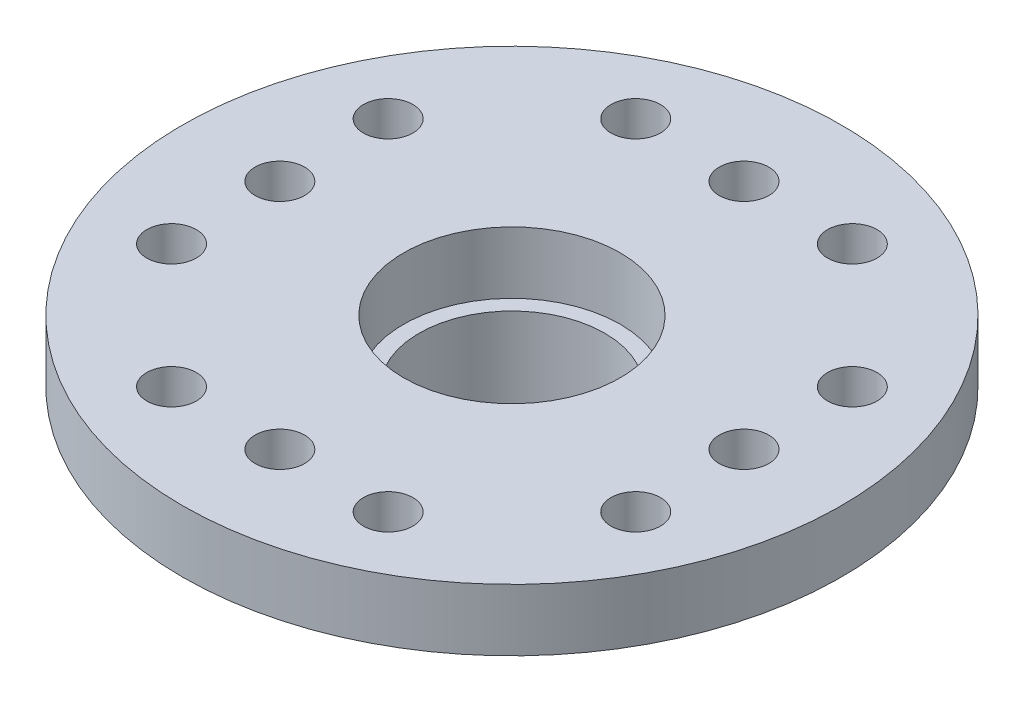
ISO-10303-21;
HEADER;
FILE_DESCRIPTION(('STEP AP214'),'2;1');
FILE_NAME('part.step','',(''),(''),'','','');
FILE_SCHEMA(('AUTOMOTIVE_DESIGN { 1 0 10303 214 1 1 1 1 }'));
ENDSEC;
DATA;
#1=APPLICATION_CONTEXT('core data for automotive mechanical design processes');
#2=APPLICATION_PROTOCOL_DEFINITION('international standard','automotive_design',2000,#1);
#3=PRODUCT_CONTEXT('',#1,'mechanical');
#4=PRODUCT('Part','Part','',(#3));
#5=PRODUCT_RELATED_PRODUCT_CATEGORY('part','',(#4));
#6=PRODUCT_DEFINITION_FORMATION('','',#4);
#7=PRODUCT_DEFINITION_CONTEXT('part definition',#1,'design');
#8=PRODUCT_DEFINITION('design','',#6,#7);
#9=PRODUCT_DEFINITION_SHAPE('','',#8);
#10=(LENGTH_UNIT() NAMED_UNIT(*) SI_UNIT(.MILLI.,.METRE.));
#11=(NAMED_UNIT(*) PLANE_ANGLE_UNIT() SI_UNIT($,.RADIAN.));
#12=(NAMED_UNIT(*) SI_UNIT($,.STERADIAN.) SOLID_ANGLE_UNIT());
#13=UNCERTAINTY_MEASURE_WITH_UNIT(LENGTH_MEASURE(1.E-05),#10,'distance_accuracy_value','');
#14=(GEOMETRIC_REPRESENTATION_CONTEXT(3) GLOBAL_UNCERTAINTY_ASSIGNED_CONTEXT((#13)) GLOBAL_UNIT_ASSIGNED_CONTEXT((#10,
#11,#12)) REPRESENTATION_CONTEXT('',''));
#15=CARTESIAN_POINT('',(0.,0.,0.));
#16=DIRECTION('',(0.,0.,1.));
#17=DIRECTION('',(1.,0.,0.));
#18=AXIS2_PLACEMENT_3D('',#15,#16,#17);
#19=CARTESIAN_POINT('',(0.,2.,0.));
#20=DIRECTION('',(0.,1.,0.));
#21=DIRECTION('',(0.,0.,1.));
#22=AXIS2_PLACEMENT_3D('',#19,#20,#21);
#23=PLANE('',#22);
#24=CARTESIAN_POINT('',(-7.5,2.,-3.5));
#25=DIRECTION('',(0.,1.,0.));
#26=DIRECTION('',(0.,0.,1.));
#27=AXIS2_PLACEMENT_3D('',#24,#25,#26);
#28=CIRCLE('',#27,0.8);
#29=CARTESIAN_POINT('',(-7.5,2.,-2.7));
#30=VERTEX_POINT('',#29);
#31=EDGE_CURVE('E109',#30,#30,#28,.T.);
#32=ORIENTED_EDGE('',*,*,#31,.F.);
#33=EDGE_LOOP('',(#32));
#34=FACE_BOUND('',#33,.T.);
#35=CARTESIAN_POINT('',(-7.5,2.,0.));
#36=DIRECTION('',(0.,1.,0.));
#37=DIRECTION('',(0.,0.,1.));
#38=AXIS2_PLACEMENT_3D('',#35,#36,#37);
#39=CIRCLE('',#38,0.800000000000001);
#40=CARTESIAN_POINT('',(-7.5,2.,0.800000000000001));
#41=VERTEX_POINT('',#40);
#42=EDGE_CURVE('E108',#41,#41,#39,.T.);
#43=ORIENTED_EDGE('',*,*,#42,.F.);
#44=EDGE_LOOP('',(#43));
#45=FACE_BOUND('',#44,.T.);
#46=CARTESIAN_POINT('',(-7.5,2.,3.5));
#47=DIRECTION('',(0.,1.,0.));
#48=DIRECTION('',(0.,0.,1.));
#49=AXIS2_PLACEMENT_3D('',#46,#47,#48);
#50=CIRCLE('',#49,0.8);
#51=CARTESIAN_POINT('',(-7.5,2.,4.3));
#52=VERTEX_POINT('',#51);
#53=EDGE_CURVE('E115',#52,#52,#50,.T.);
#54=ORIENTED_EDGE('',*,*,#53,.F.);
#55=EDGE_LOOP('',(#54));
#56=FACE_BOUND('',#55,.T.);
#57=CARTESIAN_POINT('',(-3.5,2.,7.5));
#58=DIRECTION('',(0.,1.,0.));
#59=DIRECTION('',(0.,0.,1.));
#60=AXIS2_PLACEMENT_3D('',#57,#58,#59);
#61=CIRCLE('',#60,0.8);
#62=CARTESIAN_POINT('',(-3.5,2.,8.3));
#63=VERTEX_POINT('',#62);
#64=EDGE_CURVE('E121',#63,#63,#61,.T.);
#65=ORIENTED_EDGE('',*,*,#64,.F.);
#66=EDGE_LOOP('',(#65));
#67=FACE_BOUND('',#66,.T.);
#68=CARTESIAN_POINT('',(0.,2.,7.5));
#69=DIRECTION('',(0.,1.,0.));
#70=DIRECTION('',(0.,0.,1.));
#71=AXIS2_PLACEMENT_3D('',#68,#69,#70);
#72=CIRCLE('',#71,0.8);
#73=CARTESIAN_POINT('',(0.,2.,8.3));
#74=VERTEX_POINT('',#73);
#75=EDGE_CURVE('E127',#74,#74,#72,.T.);
#76=ORIENTED_EDGE('',*,*,#75,.F.);
#77=EDGE_LOOP('',(#76));
#78=FACE_BOUND('',#77,.T.);
#79=CARTESIAN_POINT('',(3.5,2.,7.5));
#80=DIRECTION('',(0.,1.,0.));
#81=DIRECTION('',(0.,0.,1.));
#82=AXIS2_PLACEMENT_3D('',#79,#80,#81);
#83=CIRCLE('',#82,0.800000000000001);
#84=CARTESIAN_POINT('',(3.5,2.,8.3));
#85=VERTEX_POINT('',#84);
#86=EDGE_CURVE('E133',#85,#85,#83,.T.);
#87=ORIENTED_EDGE('',*,*,#86,.F.);
#88=EDGE_LOOP('',(#87));
#89=FACE_BOUND('',#88,.T.);
#90=CARTESIAN_POINT('',(7.5,2.,3.5));
#91=DIRECTION('',(0.,1.,0.));
#92=DIRECTION('',(0.,0.,1.));
#93=AXIS2_PLACEMENT_3D('',#90,#91,#92);
#94=CIRCLE('',#93,0.8);
#95=CARTESIAN_POINT('',(7.5,2.,4.3));
#96=VERTEX_POINT('',#95);
#97=EDGE_CURVE('E79',#96,#96,#94,.T.);
#98=ORIENTED_EDGE('',*,*,#97,.F.);
#99=EDGE_LOOP('',(#98));
#100=FACE_BOUND('',#99,.T.);
#101=CARTESIAN_POINT('',(7.5,2.,0.));
#102=DIRECTION('',(0.,1.,0.));
#103=DIRECTION('',(0.,0.,1.));
#104=AXIS2_PLACEMENT_3D('',#101,#102,#103);
#105=CIRCLE('',#104,0.800000000000001);
#106=CARTESIAN_POINT('',(7.5,2.,0.800000000000002));
#107=VERTEX_POINT('',#106);
#108=EDGE_CURVE('E78',#107,#107,#105,.T.);
#109=ORIENTED_EDGE('',*,*,#108,.F.);
#110=EDGE_LOOP('',(#109));
#111=FACE_BOUND('',#110,.T.);
#112=CARTESIAN_POINT('',(7.5,2.,-3.5));
#113=DIRECTION('',(0.,1.,0.));
#114=DIRECTION('',(0.,0.,1.));
#115=AXIS2_PLACEMENT_3D('',#112,#113,#114);
#116=CIRCLE('',#115,0.8);
#117=CARTESIAN_POINT('',(7.5,2.,-2.7));
#118=VERTEX_POINT('',#117);
#119=EDGE_CURVE('E86',#118,#118,#116,.T.);
#120=ORIENTED_EDGE('',*,*,#119,.F.);
#121=EDGE_LOOP('',(#120));
#122=FACE_BOUND('',#121,.T.);
#123=CARTESIAN_POINT('',(3.5,2.,-7.5));
#124=DIRECTION('',(0.,1.,0.));
#125=DIRECTION('',(0.,0.,1.));
#126=AXIS2_PLACEMENT_3D('',#123,#124,#125);
#127=CIRCLE('',#126,0.800000000000001);
#128=CARTESIAN_POINT('',(3.5,2.,-6.7));
#129=VERTEX_POINT('',#128);
#130=EDGE_CURVE('E92',#129,#129,#127,.T.);
#131=ORIENTED_EDGE('',*,*,#130,.F.);
#132=EDGE_LOOP('',(#131));
#133=FACE_BOUND('',#132,.T.);
#134=CARTESIAN_POINT('',(0.,2.,-7.5));
#135=DIRECTION('',(0.,1.,0.));
#136=DIRECTION('',(0.,0.,1.));
#137=AXIS2_PLACEMENT_3D('',#134,#135,#136);
#138=CIRCLE('',#137,0.8);
#139=CARTESIAN_POINT('',(0.,2.,-6.7));
#140=VERTEX_POINT('',#139);
#141=EDGE_CURVE('E98',#140,#140,#138,.T.);
#142=ORIENTED_EDGE('',*,*,#141,.F.);
#143=EDGE_LOOP('',(#142));
#144=FACE_BOUND('',#143,.T.);
#145=CARTESIAN_POINT('',(-3.5,2.,-7.5));
#146=DIRECTION('',(0.,1.,0.));
#147=DIRECTION('',(0.,0.,1.));
#148=AXIS2_PLACEMENT_3D('',#145,#146,#147);
#149=CIRCLE('',#148,0.8);
#150=CARTESIAN_POINT('',(-3.5,2.,-6.7));
#151=VERTEX_POINT('',#150);
#152=EDGE_CURVE('E71',#151,#151,#149,.T.);
#153=ORIENTED_EDGE('',*,*,#152,.F.);
#154=EDGE_LOOP('',(#153));
#155=FACE_BOUND('',#154,.T.);
#156=CARTESIAN_POINT('',(0.,2.,0.));
#157=DIRECTION('',(0.,1.,0.));
#158=DIRECTION('',(0.,0.,1.));
#159=AXIS2_PLACEMENT_3D('',#156,#157,#158);
#160=CIRCLE('',#159,10.65);
#161=CARTESIAN_POINT('',(0.,2.,10.65));
#162=VERTEX_POINT('',#161);
#163=EDGE_CURVE('E44',#162,#162,#160,.T.);
#164=ORIENTED_EDGE('',*,*,#163,.T.);
#165=EDGE_LOOP('',(#164));
#166=FACE_BOUND('',#165,.T.);
#167=CARTESIAN_POINT('',(0.,2.,0.));
#168=DIRECTION('',(0.,1.,0.));
#169=DIRECTION('',(0.,0.,1.));
#170=AXIS2_PLACEMENT_3D('',#167,#168,#169);
#171=CIRCLE('',#170,3.5);
#172=CARTESIAN_POINT('',(0.,2.,3.5));
#173=VERTEX_POINT('',#172);
#174=EDGE_CURVE('E52',#173,#173,#171,.T.);
#175=ORIENTED_EDGE('',*,*,#174,.F.);
#176=EDGE_LOOP('',(#175));
#177=FACE_BOUND('',#176,.T.);
#178=ADVANCED_FACE('F33',(#34,#45,#56,#67,#78,#89,#100,#111,#122,#133,#144,#155,#166,#177),#23,.T.);
#179=CARTESIAN_POINT('',(0.,0.,0.));
#180=DIRECTION('',(0.,1.,0.));
#181=DIRECTION('',(0.,0.,1.));
#182=AXIS2_PLACEMENT_3D('',#179,#180,#181);
#183=PLANE('',#182);
#184=CARTESIAN_POINT('',(-7.5,0.,-3.5));
#185=DIRECTION('',(0.,1.,0.));
#186=DIRECTION('',(0.,0.,1.));
#187=AXIS2_PLACEMENT_3D('',#184,#185,#186);
#188=CIRCLE('',#187,0.8);
#189=CARTESIAN_POINT('',(-7.5,0.,-2.7));
#190=VERTEX_POINT('',#189);
#191=EDGE_CURVE('E105',#190,#190,#188,.F.);
#192=ORIENTED_EDGE('',*,*,#191,.F.);
#193=EDGE_LOOP('',(#192));
#194=FACE_BOUND('',#193,.T.);
#195=CARTESIAN_POINT('',(-7.5,0.,0.));
#196=DIRECTION('',(0.,1.,0.));
#197=DIRECTION('',(0.,0.,1.));
#198=AXIS2_PLACEMENT_3D('',#195,#196,#197);
#199=CIRCLE('',#198,0.800000000000001);
#200=CARTESIAN_POINT('',(-7.5,0.,0.800000000000001));
#201=VERTEX_POINT('',#200);
#202=EDGE_CURVE('E112',#201,#201,#199,.F.);
#203=ORIENTED_EDGE('',*,*,#202,.F.);
#204=EDGE_LOOP('',(#203));
#205=FACE_BOUND('',#204,.T.);
#206=CARTESIAN_POINT('',(-7.5,0.,3.5));
#207=DIRECTION('',(0.,1.,0.));
#208=DIRECTION('',(0.,0.,1.));
#209=AXIS2_PLACEMENT_3D('',#206,#207,#208);
#210=CIRCLE('',#209,0.8);
#211=CARTESIAN_POINT('',(-7.5,0.,4.3));
#212=VERTEX_POINT('',#211);
#213=EDGE_CURVE('E118',#212,#212,#210,.F.);
#214=ORIENTED_EDGE('',*,*,#213,.F.);
#215=EDGE_LOOP('',(#214));
#216=FACE_BOUND('',#215,.T.);
#217=CARTESIAN_POINT('',(-3.5,0.,7.5));
#218=DIRECTION('',(0.,1.,0.));
#219=DIRECTION('',(0.,0.,1.));
#220=AXIS2_PLACEMENT_3D('',#217,#218,#219);
#221=CIRCLE('',#220,0.8);
#222=CARTESIAN_POINT('',(-3.5,0.,8.3));
#223=VERTEX_POINT('',#222);
#224=EDGE_CURVE('E124',#223,#223,#221,.F.);
#225=ORIENTED_EDGE('',*,*,#224,.F.);
#226=EDGE_LOOP('',(#225));
#227=FACE_BOUND('',#226,.T.);
#228=CARTESIAN_POINT('',(0.,0.,7.5));
#229=DIRECTION('',(0.,1.,0.));
#230=DIRECTION('',(0.,0.,1.));
#231=AXIS2_PLACEMENT_3D('',#228,#229,#230);
#232=CIRCLE('',#231,0.8);
#233=CARTESIAN_POINT('',(0.,0.,8.3));
#234=VERTEX_POINT('',#233);
#235=EDGE_CURVE('E130',#234,#234,#232,.F.);
#236=ORIENTED_EDGE('',*,*,#235,.F.);
#237=EDGE_LOOP('',(#236));
#238=FACE_BOUND('',#237,.T.);
#239=CARTESIAN_POINT('',(3.5,0.,7.5));
#240=DIRECTION('',(0.,1.,0.));
#241=DIRECTION('',(0.,0.,1.));
#242=AXIS2_PLACEMENT_3D('',#239,#240,#241);
#243=CIRCLE('',#242,0.800000000000001);
#244=CARTESIAN_POINT('',(3.5,0.,8.3));
#245=VERTEX_POINT('',#244);
#246=EDGE_CURVE('E82',#245,#245,#243,.F.);
#247=ORIENTED_EDGE('',*,*,#246,.F.);
#248=EDGE_LOOP('',(#247));
#249=FACE_BOUND('',#248,.T.);
#250=CARTESIAN_POINT('',(7.5,0.,3.5));
#251=DIRECTION('',(0.,1.,0.));
#252=DIRECTION('',(0.,0.,1.));
#253=AXIS2_PLACEMENT_3D('',#250,#251,#252);
#254=CIRCLE('',#253,0.8);
#255=CARTESIAN_POINT('',(7.5,0.,4.3));
#256=VERTEX_POINT('',#255);
#257=EDGE_CURVE('E75',#256,#256,#254,.F.);
#258=ORIENTED_EDGE('',*,*,#257,.F.);
#259=EDGE_LOOP('',(#258));
#260=FACE_BOUND('',#259,.T.);
#261=CARTESIAN_POINT('',(7.5,0.,0.));
#262=DIRECTION('',(0.,1.,0.));
#263=DIRECTION('',(0.,0.,1.));
#264=AXIS2_PLACEMENT_3D('',#261,#262,#263);
#265=CIRCLE('',#264,0.800000000000001);
#266=CARTESIAN_POINT('',(7.5,0.,0.800000000000002));
#267=VERTEX_POINT('',#266);
#268=EDGE_CURVE('E83',#267,#267,#265,.F.);
#269=ORIENTED_EDGE('',*,*,#268,.F.);
#270=EDGE_LOOP('',(#269));
#271=FACE_BOUND('',#270,.T.);
#272=CARTESIAN_POINT('',(7.5,0.,-3.5));
#273=DIRECTION('',(0.,1.,0.));
#274=DIRECTION('',(0.,0.,1.));
#275=AXIS2_PLACEMENT_3D('',#272,#273,#274);
#276=CIRCLE('',#275,0.8);
#277=CARTESIAN_POINT('',(7.5,0.,-2.7));
#278=VERTEX_POINT('',#277);
#279=EDGE_CURVE('E89',#278,#278,#276,.F.);
#280=ORIENTED_EDGE('',*,*,#279,.F.);
#281=EDGE_LOOP('',(#280));
#282=FACE_BOUND('',#281,.T.);
#283=CARTESIAN_POINT('',(3.5,0.,-7.5));
#284=DIRECTION('',(0.,1.,0.));
#285=DIRECTION('',(0.,0.,1.));
#286=AXIS2_PLACEMENT_3D('',#283,#284,#285);
#287=CIRCLE('',#286,0.800000000000001);
#288=CARTESIAN_POINT('',(3.5,0.,-6.7));
#289=VERTEX_POINT('',#288);
#290=EDGE_CURVE('E95',#289,#289,#287,.F.);
#291=ORIENTED_EDGE('',*,*,#290,.F.);
#292=EDGE_LOOP('',(#291));
#293=FACE_BOUND('',#292,.T.);
#294=CARTESIAN_POINT('',(0.,0.,-7.5));
#295=DIRECTION('',(0.,1.,0.));
#296=DIRECTION('',(0.,0.,1.));
#297=AXIS2_PLACEMENT_3D('',#294,#295,#296);
#298=CIRCLE('',#297,0.8);
#299=CARTESIAN_POINT('',(0.,0.,-6.7));
#300=VERTEX_POINT('',#299);
#301=EDGE_CURVE('E74',#300,#300,#298,.F.);
#302=ORIENTED_EDGE('',*,*,#301,.F.);
#303=EDGE_LOOP('',(#302));
#304=FACE_BOUND('',#303,.T.);
#305=CARTESIAN_POINT('',(-3.5,0.,-7.5));
#306=DIRECTION('',(0.,1.,0.));
#307=DIRECTION('',(0.,0.,1.));
#308=AXIS2_PLACEMENT_3D('',#305,#306,#307);
#309=CIRCLE('',#308,0.8);
#310=CARTESIAN_POINT('',(-3.5,0.,-6.7));
#311=VERTEX_POINT('',#310);
#312=EDGE_CURVE('E66',#311,#311,#309,.F.);
#313=ORIENTED_EDGE('',*,*,#312,.F.);
#314=EDGE_LOOP('',(#313));
#315=FACE_BOUND('',#314,.T.);
#316=CARTESIAN_POINT('',(0.,0.,0.));
#317=DIRECTION('',(0.,1.,0.));
#318=DIRECTION('',(0.,0.,1.));
#319=AXIS2_PLACEMENT_3D('',#316,#317,#318);
#320=CIRCLE('',#319,5.3);
#321=CARTESIAN_POINT('',(0.,0.,5.3));
#322=VERTEX_POINT('',#321);
#323=EDGE_CURVE('E10',#322,#322,#320,.T.);
#324=ORIENTED_EDGE('',*,*,#323,.T.);
#325=EDGE_LOOP('',(#324));
#326=FACE_BOUND('',#325,.T.);
#327=CARTESIAN_POINT('',(0.,0.,0.));
#328=DIRECTION('',(0.,1.,0.));
#329=DIRECTION('',(0.,0.,1.));
#330=AXIS2_PLACEMENT_3D('',#327,#328,#329);
#331=CIRCLE('',#330,10.65);
#332=CARTESIAN_POINT('',(0.,0.,10.65));
#333=VERTEX_POINT('',#332);
#334=EDGE_CURVE('E48',#333,#333,#331,.T.);
#335=ORIENTED_EDGE('',*,*,#334,.F.);
#336=EDGE_LOOP('',(#335));
#337=FACE_BOUND('',#336,.T.);
#338=ADVANCED_FACE('F146',(#194,#205,#216,#227,#238,#249,#260,#271,#282,#293,#304,#315,#326,
#337),#183,.F.);
#339=CARTESIAN_POINT('',(0.,2.,0.));
#340=DIRECTION('',(0.,-1.,0.));
#341=DIRECTION('',(0.,0.,-1.));
#342=AXIS2_PLACEMENT_3D('',#339,#340,#341);
#343=CYLINDRICAL_SURFACE('',#342,10.65);
#344=ORIENTED_EDGE('',*,*,#163,.F.);
#345=EDGE_LOOP('',(#344));
#346=FACE_BOUND('',#345,.T.);
#347=ORIENTED_EDGE('',*,*,#334,.T.);
#348=EDGE_LOOP('',(#347));
#349=FACE_BOUND('',#348,.T.);
#350=ADVANCED_FACE('F169',(#346,#349),#343,.T.);
#351=CARTESIAN_POINT('',(0.,2.,0.));
#352=DIRECTION('',(0.,-1.,0.));
#353=DIRECTION('',(0.,0.,-1.));
#354=AXIS2_PLACEMENT_3D('',#351,#352,#353);
#355=CYLINDRICAL_SURFACE('',#354,3.5);
#356=ORIENTED_EDGE('',*,*,#174,.T.);
#357=EDGE_LOOP('',(#356));
#358=FACE_BOUND('',#357,.T.);
#359=CARTESIAN_POINT('',(0.,0.,0.));
#360=DIRECTION('',(0.,1.,0.));
#361=DIRECTION('',(0.,0.,1.));
#362=AXIS2_PLACEMENT_3D('',#359,#360,#361);
#363=CIRCLE('',#362,3.5);
#364=CARTESIAN_POINT('',(0.,0.,3.5));
#365=VERTEX_POINT('',#364);
#366=EDGE_CURVE('E54',#365,#365,#363,.T.);
#367=ORIENTED_EDGE('',*,*,#366,.F.);
#368=EDGE_LOOP('',(#367));
#369=FACE_BOUND('',#368,.T.);
#370=ADVANCED_FACE('F165',(#358,#369),#355,.F.);
#371=CARTESIAN_POINT('',(0.,0.,0.));
#372=DIRECTION('',(0.,-1.,0.));
#373=DIRECTION('',(0.,0.,-1.));
#374=AXIS2_PLACEMENT_3D('',#371,#372,#373);
#375=PLANE('',#374);
#376=CARTESIAN_POINT('',(0.,0.,0.));
#377=DIRECTION('',(0.,-1.,0.));
#378=DIRECTION('',(0.,0.,-1.));
#379=AXIS2_PLACEMENT_3D('',#376,#377,#378);
#380=CIRCLE('',#379,3.);
#381=CARTESIAN_POINT('',(0.,0.,-3.));
#382=VERTEX_POINT('',#381);
#383=EDGE_CURVE('E63',#382,#382,#380,.T.);
#384=ORIENTED_EDGE('',*,*,#383,.T.);
#385=EDGE_LOOP('',(#384));
#386=FACE_BOUND('',#385,.T.);
#387=ORIENTED_EDGE('',*,*,#366,.T.);
#388=EDGE_LOOP('',(#387));
#389=FACE_BOUND('',#388,.T.);
#390=ADVANCED_FACE('F168',(#386,#389),#375,.F.);
#391=CARTESIAN_POINT('',(0.,-3.8,0.));
#392=DIRECTION('',(0.,-1.,0.));
#393=DIRECTION('',(0.,0.,-1.));
#394=AXIS2_PLACEMENT_3D('',#391,#392,#393);
#395=PLANE('',#394);
#396=CARTESIAN_POINT('',(0.,-3.8,0.));
#397=DIRECTION('',(0.,-1.,0.));
#398=DIRECTION('',(0.,0.,-1.));
#399=AXIS2_PLACEMENT_3D('',#396,#397,#398);
#400=CIRCLE('',#399,4.3);
#401=CARTESIAN_POINT('',(0.,-3.8,-4.3));
#402=VERTEX_POINT('',#401);
#403=EDGE_CURVE('E57',#402,#402,#400,.T.);
#404=ORIENTED_EDGE('',*,*,#403,.T.);
#405=EDGE_LOOP('',(#404));
#406=FACE_BOUND('',#405,.T.);
#407=CARTESIAN_POINT('',(0.,-3.8,0.));
#408=DIRECTION('',(0.,-1.,0.));
#409=DIRECTION('',(0.,0.,-1.));
#410=AXIS2_PLACEMENT_3D('',#407,#408,#409);
#411=CIRCLE('',#410,3.);
#412=CARTESIAN_POINT('',(0.,-3.8,-3.));
#413=VERTEX_POINT('',#412);
#414=EDGE_CURVE('E62',#413,#413,#411,.T.);
#415=ORIENTED_EDGE('',*,*,#414,.F.);
#416=EDGE_LOOP('',(#415));
#417=FACE_BOUND('',#416,.T.);
#418=ADVANCED_FACE('F174',(#406,#417),#395,.T.);
#419=CARTESIAN_POINT('',(0.,-3.8,0.));
#420=DIRECTION('',(0.,1.,0.));
#421=DIRECTION('',(0.,0.,1.));
#422=AXIS2_PLACEMENT_3D('',#419,#420,#421);
#423=CYLINDRICAL_SURFACE('',#422,4.3);
#424=CARTESIAN_POINT('',(0.,-1.,0.));
#425=DIRECTION('',(0.,1.,0.));
#426=DIRECTION('',(0.,0.,1.));
#427=AXIS2_PLACEMENT_3D('',#424,#425,#426);
#428=CIRCLE('',#427,4.3);
#429=CARTESIAN_POINT('',(0.,-1.,4.3));
#430=VERTEX_POINT('',#429);
#431=EDGE_CURVE('E40',#430,#430,#428,.F.);
#432=ORIENTED_EDGE('',*,*,#431,.T.);
#433=EDGE_LOOP('',(#432));
#434=FACE_BOUND('',#433,.T.);
#435=ORIENTED_EDGE('',*,*,#403,.F.);
#436=EDGE_LOOP('',(#435));
#437=FACE_BOUND('',#436,.T.);
#438=ADVANCED_FACE('F180',(#434,#437),#423,.T.);
#439=CARTESIAN_POINT('',(0.,-3.8,0.));
#440=DIRECTION('',(0.,1.,0.));
#441=DIRECTION('',(0.,0.,1.));
#442=AXIS2_PLACEMENT_3D('',#439,#440,#441);
#443=CYLINDRICAL_SURFACE('',#442,3.);
#444=ORIENTED_EDGE('',*,*,#414,.T.);
#445=EDGE_LOOP('',(#444));
#446=FACE_BOUND('',#445,.T.);
#447=ORIENTED_EDGE('',*,*,#383,.F.);
#448=EDGE_LOOP('',(#447));
#449=FACE_BOUND('',#448,.T.);
#450=ADVANCED_FACE('F186',(#446,#449),#443,.F.);
#451=CARTESIAN_POINT('',(0.,-1.,0.));
#452=DIRECTION('',(0.,1.,0.));
#453=DIRECTION('',(0.,0.,1.));
#454=AXIS2_PLACEMENT_3D('',#451,#452,#453);
#455=TOROIDAL_SURFACE('',#454,5.3,1.);
#456=ORIENTED_EDGE('',*,*,#323,.F.);
#457=EDGE_LOOP('',(#456));
#458=FACE_BOUND('',#457,.T.);
#459=ORIENTED_EDGE('',*,*,#431,.F.);
#460=EDGE_LOOP('',(#459));
#461=FACE_BOUND('',#460,.T.);
#462=ADVANCED_FACE('F35',(#458,#461),#455,.F.);
#463=CARTESIAN_POINT('',(-3.5,-3.801,-7.5));
#464=DIRECTION('',(0.,1.,0.));
#465=DIRECTION('',(0.,0.,1.));
#466=AXIS2_PLACEMENT_3D('',#463,#464,#465);
#467=CYLINDRICAL_SURFACE('',#466,0.8);
#468=ORIENTED_EDGE('',*,*,#152,.T.);
#469=EDGE_LOOP('',(#468));
#470=FACE_BOUND('',#469,.T.);
#471=ORIENTED_EDGE('',*,*,#312,.T.);
#472=EDGE_LOOP('',(#471));
#473=FACE_BOUND('',#472,.T.);
#474=ADVANCED_FACE('F236',(#470,#473),#467,.F.);
#475=CARTESIAN_POINT('',(0.,-3.801,-7.5));
#476=DIRECTION('',(0.,1.,0.));
#477=DIRECTION('',(0.,0.,1.));
#478=AXIS2_PLACEMENT_3D('',#475,#476,#477);
#479=CYLINDRICAL_SURFACE('',#478,0.8);
#480=ORIENTED_EDGE('',*,*,#141,.T.);
#481=EDGE_LOOP('',(#480));
#482=FACE_BOUND('',#481,.T.);
#483=ORIENTED_EDGE('',*,*,#301,.T.);
#484=EDGE_LOOP('',(#483));
#485=FACE_BOUND('',#484,.T.);
#486=ADVANCED_FACE('F255',(#482,#485),#479,.F.);
#487=CARTESIAN_POINT('',(3.5,-3.801,-7.5));
#488=DIRECTION('',(0.,1.,0.));
#489=DIRECTION('',(0.,0.,1.));
#490=AXIS2_PLACEMENT_3D('',#487,#488,#489);
#491=CYLINDRICAL_SURFACE('',#490,0.800000000000001);
#492=ORIENTED_EDGE('',*,*,#130,.T.);
#493=EDGE_LOOP('',(#492));
#494=FACE_BOUND('',#493,.T.);
#495=ORIENTED_EDGE('',*,*,#290,.T.);
#496=EDGE_LOOP('',(#495));
#497=FACE_BOUND('',#496,.T.);
#498=ADVANCED_FACE('F265',(#494,#497),#491,.F.);
#499=CARTESIAN_POINT('',(7.5,-3.801,-3.5));
#500=DIRECTION('',(0.,1.,0.));
#501=DIRECTION('',(0.,0.,1.));
#502=AXIS2_PLACEMENT_3D('',#499,#500,#501);
#503=CYLINDRICAL_SURFACE('',#502,0.8);
#504=ORIENTED_EDGE('',*,*,#119,.T.);
#505=EDGE_LOOP('',(#504));
#506=FACE_BOUND('',#505,.T.);
#507=ORIENTED_EDGE('',*,*,#279,.T.);
#508=EDGE_LOOP('',(#507));
#509=FACE_BOUND('',#508,.T.);
#510=ADVANCED_FACE('F275',(#506,#509),#503,.F.);
#511=CARTESIAN_POINT('',(7.5,-3.801,0.));
#512=DIRECTION('',(0.,1.,0.));
#513=DIRECTION('',(0.,0.,1.));
#514=AXIS2_PLACEMENT_3D('',#511,#512,#513);
#515=CYLINDRICAL_SURFACE('',#514,0.800000000000001);
#516=ORIENTED_EDGE('',*,*,#108,.T.);
#517=EDGE_LOOP('',(#516));
#518=FACE_BOUND('',#517,.T.);
#519=ORIENTED_EDGE('',*,*,#268,.T.);
#520=EDGE_LOOP('',(#519));
#521=FACE_BOUND('',#520,.T.);
#522=ADVANCED_FACE('F285',(#518,#521),#515,.F.);
#523=CARTESIAN_POINT('',(7.5,-3.801,3.5));
#524=DIRECTION('',(0.,1.,0.));
#525=DIRECTION('',(0.,0.,1.));
#526=AXIS2_PLACEMENT_3D('',#523,#524,#525);
#527=CYLINDRICAL_SURFACE('',#526,0.8);
#528=ORIENTED_EDGE('',*,*,#97,.T.);
#529=EDGE_LOOP('',(#528));
#530=FACE_BOUND('',#529,.T.);
#531=ORIENTED_EDGE('',*,*,#257,.T.);
#532=EDGE_LOOP('',(#531));
#533=FACE_BOUND('',#532,.T.);
#534=ADVANCED_FACE('F295',(#530,#533),#527,.F.);
#535=CARTESIAN_POINT('',(3.5,-3.801,7.5));
#536=DIRECTION('',(0.,1.,0.));
#537=DIRECTION('',(0.,0.,1.));
#538=AXIS2_PLACEMENT_3D('',#535,#536,#537);
#539=CYLINDRICAL_SURFACE('',#538,0.800000000000001);
#540=ORIENTED_EDGE('',*,*,#86,.T.);
#541=EDGE_LOOP('',(#540));
#542=FACE_BOUND('',#541,.T.);
#543=ORIENTED_EDGE('',*,*,#246,.T.);
#544=EDGE_LOOP('',(#543));
#545=FACE_BOUND('',#544,.T.);
#546=ADVANCED_FACE('F141',(#542,#545),#539,.F.);
#547=CARTESIAN_POINT('',(0.,-3.801,7.5));
#548=DIRECTION('',(0.,1.,0.));
#549=DIRECTION('',(0.,0.,1.));
#550=AXIS2_PLACEMENT_3D('',#547,#548,#549);
#551=CYLINDRICAL_SURFACE('',#550,0.8);
#552=ORIENTED_EDGE('',*,*,#75,.T.);
#553=EDGE_LOOP('',(#552));
#554=FACE_BOUND('',#553,.T.);
#555=ORIENTED_EDGE('',*,*,#235,.T.);
#556=EDGE_LOOP('',(#555));
#557=FACE_BOUND('',#556,.T.);
#558=ADVANCED_FACE('F314',(#554,#557),#551,.F.);
#559=CARTESIAN_POINT('',(-3.5,-3.801,7.5));
#560=DIRECTION('',(0.,1.,0.));
#561=DIRECTION('',(0.,0.,1.));
#562=AXIS2_PLACEMENT_3D('',#559,#560,#561);
#563=CYLINDRICAL_SURFACE('',#562,0.8);
#564=ORIENTED_EDGE('',*,*,#64,.T.);
#565=EDGE_LOOP('',(#564));
#566=FACE_BOUND('',#565,.T.);
#567=ORIENTED_EDGE('',*,*,#224,.T.);
#568=EDGE_LOOP('',(#567));
#569=FACE_BOUND('',#568,.T.);
#570=ADVANCED_FACE('F323',(#566,#569),#563,.F.);
#571=CARTESIAN_POINT('',(-7.5,-3.801,3.5));
#572=DIRECTION('',(0.,1.,0.));
#573=DIRECTION('',(0.,0.,1.));
#574=AXIS2_PLACEMENT_3D('',#571,#572,#573);
#575=CYLINDRICAL_SURFACE('',#574,0.8);
#576=ORIENTED_EDGE('',*,*,#53,.T.);
#577=EDGE_LOOP('',(#576));
#578=FACE_BOUND('',#577,.T.);
#579=ORIENTED_EDGE('',*,*,#213,.T.);
#580=EDGE_LOOP('',(#579));
#581=FACE_BOUND('',#580,.T.);
#582=ADVANCED_FACE('F333',(#578,#581),#575,.F.);
#583=CARTESIAN_POINT('',(-7.5,-3.801,0.));
#584=DIRECTION('',(0.,1.,0.));
#585=DIRECTION('',(0.,0.,1.));
#586=AXIS2_PLACEMENT_3D('',#583,#584,#585);
#587=CYLINDRICAL_SURFACE('',#586,0.800000000000001);
#588=ORIENTED_EDGE('',*,*,#42,.T.);
#589=EDGE_LOOP('',(#588));
#590=FACE_BOUND('',#589,.T.);
#591=ORIENTED_EDGE('',*,*,#202,.T.);
#592=EDGE_LOOP('',(#591));
#593=FACE_BOUND('',#592,.T.);
#594=ADVANCED_FACE('F343',(#590,#593),#587,.F.);
#595=CARTESIAN_POINT('',(-7.5,-3.801,-3.5));
#596=DIRECTION('',(0.,1.,0.));
#597=DIRECTION('',(0.,0.,1.));
#598=AXIS2_PLACEMENT_3D('',#595,#596,#597);
#599=CYLINDRICAL_SURFACE('',#598,0.8);
#600=ORIENTED_EDGE('',*,*,#31,.T.);
#601=EDGE_LOOP('',(#600));
#602=FACE_BOUND('',#601,.T.);
#603=ORIENTED_EDGE('',*,*,#191,.T.);
#604=EDGE_LOOP('',(#603));
#605=FACE_BOUND('',#604,.T.);
#606=ADVANCED_FACE('F353',(#602,#605),#599,.F.);
#607=CLOSED_SHELL('',(#178,#338,#350,#370,#390,#418,#438,#450,#462,#474,#486,#498,#510,#522,
#534,#546,#558,#570,#582,#594,#606));
#608=MANIFOLD_SOLID_BREP('B2',#607);
#609=ADVANCED_BREP_SHAPE_REPRESENTATION('',(#18,#608),#14);
#610=SHAPE_DEFINITION_REPRESENTATION(#9,#609);
ENDSEC;
END-ISO-10303-21;
